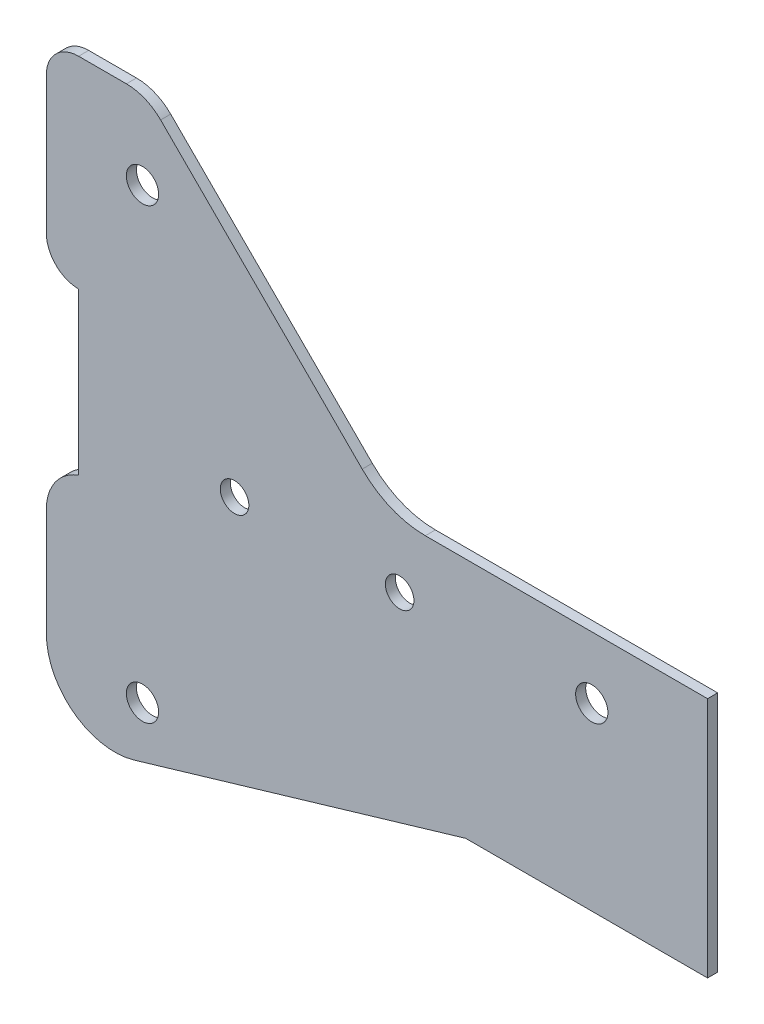
ISO-10303-21;
HEADER;
FILE_DESCRIPTION(('STEP AP214'),'2;1');
FILE_NAME('part.step','',(''),(''),'','','');
FILE_SCHEMA(('AUTOMOTIVE_DESIGN { 1 0 10303 214 1 1 1 1 }'));
ENDSEC;
DATA;
#1=APPLICATION_CONTEXT('core data for automotive mechanical design processes');
#2=APPLICATION_PROTOCOL_DEFINITION('international standard','automotive_design',2000,#1);
#3=PRODUCT_CONTEXT('',#1,'mechanical');
#4=PRODUCT('Part','Part','',(#3));
#5=PRODUCT_RELATED_PRODUCT_CATEGORY('part','',(#4));
#6=PRODUCT_DEFINITION_FORMATION('','',#4);
#7=PRODUCT_DEFINITION_CONTEXT('part definition',#1,'design');
#8=PRODUCT_DEFINITION('design','',#6,#7);
#9=PRODUCT_DEFINITION_SHAPE('','',#8);
#10=(LENGTH_UNIT() NAMED_UNIT(*) SI_UNIT(.MILLI.,.METRE.));
#11=(NAMED_UNIT(*) PLANE_ANGLE_UNIT() SI_UNIT($,.RADIAN.));
#12=(NAMED_UNIT(*) SI_UNIT($,.STERADIAN.) SOLID_ANGLE_UNIT());
#13=UNCERTAINTY_MEASURE_WITH_UNIT(LENGTH_MEASURE(1.E-05),#10,'distance_accuracy_value','');
#14=(GEOMETRIC_REPRESENTATION_CONTEXT(3) GLOBAL_UNCERTAINTY_ASSIGNED_CONTEXT((#13)) GLOBAL_UNIT_ASSIGNED_CONTEXT((#10,
#11,#12)) REPRESENTATION_CONTEXT('',''));
#15=CARTESIAN_POINT('',(0.,0.,0.));
#16=DIRECTION('',(0.,0.,1.));
#17=DIRECTION('',(1.,0.,0.));
#18=AXIS2_PLACEMENT_3D('',#15,#16,#17);
#19=CARTESIAN_POINT('',(-93.3643185723685,-43.1993185723686,1.5875));
#20=DIRECTION('',(0.,0.,1.));
#21=DIRECTION('',(1.,0.,0.));
#22=AXIS2_PLACEMENT_3D('',#19,#20,#21);
#23=PLANE('',#22);
#24=CARTESIAN_POINT('',(-74.5,-9.75000000000002,1.5875));
#25=DIRECTION('',(0.,0.,1.));
#26=DIRECTION('',(1.,0.,0.));
#27=AXIS2_PLACEMENT_3D('',#24,#25,#26);
#28=CIRCLE('',#27,2.25);
#29=CARTESIAN_POINT('',(-72.25,-9.75000000000002,1.5875));
#30=VERTEX_POINT('',#29);
#31=EDGE_CURVE('E334',#30,#30,#28,.T.);
#32=ORIENTED_EDGE('',*,*,#31,.F.);
#33=EDGE_LOOP('',(#32));
#34=FACE_BOUND('',#33,.T.);
#35=CARTESIAN_POINT('',(-89.,25.555,1.5875));
#36=DIRECTION('',(0.,0.,1.));
#37=DIRECTION('',(1.,0.,0.));
#38=AXIS2_PLACEMENT_3D('',#35,#36,#37);
#39=CIRCLE('',#38,2.53999999999998);
#40=CARTESIAN_POINT('',(-86.46,25.555,1.5875));
#41=VERTEX_POINT('',#40);
#42=EDGE_CURVE('E346',#41,#41,#39,.T.);
#43=ORIENTED_EDGE('',*,*,#42,.F.);
#44=EDGE_LOOP('',(#43));
#45=FACE_BOUND('',#44,.T.);
#46=DIRECTION('',(0.,1.,0.));
#47=VECTOR('',#46,1.);
#48=CARTESIAN_POINT('',(0.,0.,1.5875));
#49=LINE('',#48,#47);
#50=CARTESIAN_POINT('',(0.,-38.1,1.5875));
#51=VERTEX_POINT('',#50);
#52=CARTESIAN_POINT('',(0.,0.,1.5875));
#53=VERTEX_POINT('',#52);
#54=EDGE_CURVE('E201',#51,#53,#49,.T.);
#55=ORIENTED_EDGE('',*,*,#54,.T.);
#56=DIRECTION('',(-1.,0.,0.));
#57=VECTOR('',#56,1.);
#58=CARTESIAN_POINT('',(0.,0.,1.5875));
#59=LINE('',#58,#57);
#60=CARTESIAN_POINT('',(-44.45,0.,1.5875));
#61=VERTEX_POINT('',#60);
#62=EDGE_CURVE('E114',#53,#61,#59,.T.);
#63=ORIENTED_EDGE('',*,*,#62,.T.);
#64=CARTESIAN_POINT('',(-44.45,14.0602561210687,1.5875));
#65=DIRECTION('',(0.,0.,-1.));
#66=DIRECTION('',(1.,0.,0.));
#67=AXIS2_PLACEMENT_3D('',#64,#65,#66);
#68=CIRCLE('',#67,14.0602561210687);
#69=CARTESIAN_POINT('',(-54.3921024484273,4.11815367264137,1.5875));
#70=VERTEX_POINT('',#69);
#71=EDGE_CURVE('E237',#61,#70,#68,.T.);
#72=ORIENTED_EDGE('',*,*,#71,.T.);
#73=DIRECTION('',(-0.707106781186547,0.707106781186548,0.));
#74=VECTOR('',#73,1.);
#75=CARTESIAN_POINT('',(-54.3921024484273,4.11815367264137,1.5875));
#76=LINE('',#75,#74);
#77=CARTESIAN_POINT('',(-86.1421024484273,35.8681536726415,1.5875));
#78=VERTEX_POINT('',#77);
#79=EDGE_CURVE('E256',#70,#78,#76,.T.);
#80=ORIENTED_EDGE('',*,*,#79,.T.);
#81=CARTESIAN_POINT('',(-91.5302561210688,30.48,1.5875));
#82=DIRECTION('',(0.,0.,1.));
#83=DIRECTION('',(-1.,0.,0.));
#84=AXIS2_PLACEMENT_3D('',#81,#82,#83);
#85=CIRCLE('',#84,7.61999999999999);
#86=CARTESIAN_POINT('',(-91.5302561210688,38.1,1.5875));
#87=VERTEX_POINT('',#86);
#88=EDGE_CURVE('E253',#78,#87,#85,.T.);
#89=ORIENTED_EDGE('',*,*,#88,.T.);
#90=DIRECTION('',(-1.,0.,0.));
#91=VECTOR('',#90,1.);
#92=CARTESIAN_POINT('',(-99.06,38.1,1.5875));
#93=LINE('',#92,#91);
#94=CARTESIAN_POINT('',(-99.06,38.1,1.5875));
#95=VERTEX_POINT('',#94);
#96=EDGE_CURVE('E255',#87,#95,#93,.T.);
#97=ORIENTED_EDGE('',*,*,#96,.T.);
#98=CARTESIAN_POINT('',(-99.06,33.02,1.5875));
#99=DIRECTION('',(0.,0.,1.));
#100=DIRECTION('',(1.,0.,0.));
#101=AXIS2_PLACEMENT_3D('',#98,#99,#100);
#102=CIRCLE('',#101,5.08);
#103=CARTESIAN_POINT('',(-104.14,33.02,1.5875));
#104=VERTEX_POINT('',#103);
#105=EDGE_CURVE('E258',#95,#104,#102,.T.);
#106=ORIENTED_EDGE('',*,*,#105,.T.);
#107=DIRECTION('',(0.,-1.,0.));
#108=VECTOR('',#107,1.);
#109=CARTESIAN_POINT('',(-104.14,33.02,1.5875));
#110=LINE('',#109,#108);
#111=CARTESIAN_POINT('',(-104.14,11.43,1.5875));
#112=VERTEX_POINT('',#111);
#113=EDGE_CURVE('E264',#104,#112,#110,.T.);
#114=ORIENTED_EDGE('',*,*,#113,.T.);
#115=CARTESIAN_POINT('',(-99.06,11.43,1.5875));
#116=DIRECTION('',(0.,0.,1.));
#117=DIRECTION('',(1.,0.,0.));
#118=AXIS2_PLACEMENT_3D('',#115,#116,#117);
#119=CIRCLE('',#118,5.08);
#120=CARTESIAN_POINT('',(-99.06,6.35,1.5875));
#121=VERTEX_POINT('',#120);
#122=EDGE_CURVE('E266',#112,#121,#119,.T.);
#123=ORIENTED_EDGE('',*,*,#122,.T.);
#124=DIRECTION('',(0.,-1.,0.));
#125=VECTOR('',#124,1.);
#126=CARTESIAN_POINT('',(-99.06,6.35,1.5875));
#127=LINE('',#126,#125);
#128=CARTESIAN_POINT('',(-99.06,-19.05,1.5875));
#129=VERTEX_POINT('',#128);
#130=EDGE_CURVE('E268',#121,#129,#127,.T.);
#131=ORIENTED_EDGE('',*,*,#130,.T.);
#132=CARTESIAN_POINT('',(-96.52,-26.2342048968553,1.5875));
#133=DIRECTION('',(0.,0.,1.));
#134=DIRECTION('',(1.,0.,0.));
#135=AXIS2_PLACEMENT_3D('',#132,#133,#134);
#136=CIRCLE('',#135,7.61999999999999);
#137=CARTESIAN_POINT('',(-104.14,-26.2342048968553,1.5875));
#138=VERTEX_POINT('',#137);
#139=EDGE_CURVE('E270',#129,#138,#136,.T.);
#140=ORIENTED_EDGE('',*,*,#139,.T.);
#141=DIRECTION('',(0.,-1.,0.));
#142=VECTOR('',#141,1.);
#143=CARTESIAN_POINT('',(-104.14,-26.2342048968553,1.5875));
#144=LINE('',#143,#142);
#145=CARTESIAN_POINT('',(-104.14,-43.1993185723686,1.5875));
#146=VERTEX_POINT('',#145);
#147=EDGE_CURVE('E154',#138,#146,#144,.T.);
#148=ORIENTED_EDGE('',*,*,#147,.T.);
#149=CARTESIAN_POINT('',(-93.3643185723685,-43.1993185723686,1.5875));
#150=DIRECTION('',(0.,0.,1.));
#151=DIRECTION('',(1.,0.,0.));
#152=AXIS2_PLACEMENT_3D('',#149,#150,#151);
#153=CIRCLE('',#152,10.7756814276314);
#154=CARTESIAN_POINT('',(-90.309725680807,-53.5329903542969,1.5875));
#155=VERTEX_POINT('',#154);
#156=EDGE_CURVE('E148',#146,#155,#153,.T.);
#157=ORIENTED_EDGE('',*,*,#156,.T.);
#158=DIRECTION('',(0.958980817253038,0.283470972307035,0.));
#159=VECTOR('',#158,1.);
#160=CARTESIAN_POINT('',(-38.1,-38.1,1.5875));
#161=LINE('',#160,#159);
#162=CARTESIAN_POINT('',(-38.1,-38.1,1.5875));
#163=VERTEX_POINT('',#162);
#164=EDGE_CURVE('E152',#155,#163,#161,.T.);
#165=ORIENTED_EDGE('',*,*,#164,.T.);
#166=DIRECTION('',(1.,0.,0.));
#167=VECTOR('',#166,1.);
#168=CARTESIAN_POINT('',(0.,-38.1,1.5875));
#169=LINE('',#168,#167);
#170=EDGE_CURVE('E50',#163,#51,#169,.T.);
#171=ORIENTED_EDGE('',*,*,#170,.T.);
#172=EDGE_LOOP('',(#55,#63,#72,#80,#89,#97,#106,#114,#123,#131,#140,#148,#157,#165,#171));
#173=FACE_BOUND('',#172,.T.);
#174=CARTESIAN_POINT('',(-89.,-45.055,1.5875));
#175=DIRECTION('',(0.,0.,1.));
#176=DIRECTION('',(1.,0.,0.));
#177=AXIS2_PLACEMENT_3D('',#174,#175,#176);
#178=CIRCLE('',#177,2.54);
#179=CARTESIAN_POINT('',(-86.46,-45.055,1.5875));
#180=VERTEX_POINT('',#179);
#181=EDGE_CURVE('E176',#180,#180,#178,.T.);
#182=ORIENTED_EDGE('',*,*,#181,.F.);
#183=EDGE_LOOP('',(#182));
#184=FACE_BOUND('',#183,.T.);
#185=CARTESIAN_POINT('',(-18.24,-9.75,1.5875));
#186=DIRECTION('',(0.,0.,1.));
#187=DIRECTION('',(1.,0.,0.));
#188=AXIS2_PLACEMENT_3D('',#185,#186,#187);
#189=CIRCLE('',#188,2.54);
#190=CARTESIAN_POINT('',(-15.7,-9.75,1.5875));
#191=VERTEX_POINT('',#190);
#192=EDGE_CURVE('E340',#191,#191,#189,.T.);
#193=ORIENTED_EDGE('',*,*,#192,.F.);
#194=EDGE_LOOP('',(#193));
#195=FACE_BOUND('',#194,.T.);
#196=CARTESIAN_POINT('',(-48.5,-9.75000000000002,1.5875));
#197=DIRECTION('',(0.,0.,1.));
#198=DIRECTION('',(1.,0.,0.));
#199=AXIS2_PLACEMENT_3D('',#196,#197,#198);
#200=CIRCLE('',#199,2.25);
#201=CARTESIAN_POINT('',(-46.25,-9.75000000000002,1.5875));
#202=VERTEX_POINT('',#201);
#203=EDGE_CURVE('E325',#202,#202,#200,.T.);
#204=ORIENTED_EDGE('',*,*,#203,.F.);
#205=EDGE_LOOP('',(#204));
#206=FACE_BOUND('',#205,.T.);
#207=ADVANCED_FACE('F33',(#34,#45,#173,#184,#195,#206),#23,.T.);
#208=CARTESIAN_POINT('',(-93.3643185723685,-43.1993185723686,0.));
#209=DIRECTION('',(0.,0.,1.));
#210=DIRECTION('',(1.,0.,0.));
#211=AXIS2_PLACEMENT_3D('',#208,#209,#210);
#212=PLANE('',#211);
#213=DIRECTION('',(0.,1.,0.));
#214=VECTOR('',#213,1.);
#215=CARTESIAN_POINT('',(0.,0.,0.));
#216=LINE('',#215,#214);
#217=CARTESIAN_POINT('',(0.,-38.1,0.));
#218=VERTEX_POINT('',#217);
#219=CARTESIAN_POINT('',(0.,0.,0.));
#220=VERTEX_POINT('',#219);
#221=EDGE_CURVE('E172',#218,#220,#216,.T.);
#222=ORIENTED_EDGE('',*,*,#221,.F.);
#223=DIRECTION('',(1.,0.,0.));
#224=VECTOR('',#223,1.);
#225=CARTESIAN_POINT('',(0.,-38.1,0.));
#226=LINE('',#225,#224);
#227=CARTESIAN_POINT('',(-38.1,-38.1,0.));
#228=VERTEX_POINT('',#227);
#229=EDGE_CURVE('E106',#228,#218,#226,.T.);
#230=ORIENTED_EDGE('',*,*,#229,.F.);
#231=DIRECTION('',(0.958980817253038,0.283470972307035,0.));
#232=VECTOR('',#231,1.);
#233=CARTESIAN_POINT('',(-38.1,-38.1,0.));
#234=LINE('',#233,#232);
#235=CARTESIAN_POINT('',(-90.309725680807,-53.5329903542969,0.));
#236=VERTEX_POINT('',#235);
#237=EDGE_CURVE('E100',#236,#228,#234,.T.);
#238=ORIENTED_EDGE('',*,*,#237,.F.);
#239=CARTESIAN_POINT('',(-93.3643185723685,-43.1993185723686,0.));
#240=DIRECTION('',(0.,0.,1.));
#241=DIRECTION('',(1.,0.,0.));
#242=AXIS2_PLACEMENT_3D('',#239,#240,#241);
#243=CIRCLE('',#242,10.7756814276314);
#244=CARTESIAN_POINT('',(-104.14,-43.1993185723686,0.));
#245=VERTEX_POINT('',#244);
#246=EDGE_CURVE('E162',#245,#236,#243,.T.);
#247=ORIENTED_EDGE('',*,*,#246,.F.);
#248=DIRECTION('',(0.,-1.,0.));
#249=VECTOR('',#248,1.);
#250=CARTESIAN_POINT('',(-104.14,-26.2342048968553,0.));
#251=LINE('',#250,#249);
#252=CARTESIAN_POINT('',(-104.14,-26.2342048968553,0.));
#253=VERTEX_POINT('',#252);
#254=EDGE_CURVE('E196',#253,#245,#251,.T.);
#255=ORIENTED_EDGE('',*,*,#254,.F.);
#256=CARTESIAN_POINT('',(-96.52,-26.2342048968553,0.));
#257=DIRECTION('',(0.,0.,1.));
#258=DIRECTION('',(1.,0.,0.));
#259=AXIS2_PLACEMENT_3D('',#256,#257,#258);
#260=CIRCLE('',#259,7.61999999999999);
#261=CARTESIAN_POINT('',(-99.06,-19.05,0.));
#262=VERTEX_POINT('',#261);
#263=EDGE_CURVE('E194',#262,#253,#260,.T.);
#264=ORIENTED_EDGE('',*,*,#263,.F.);
#265=DIRECTION('',(0.,-1.,0.));
#266=VECTOR('',#265,1.);
#267=CARTESIAN_POINT('',(-99.06,6.35,0.));
#268=LINE('',#267,#266);
#269=CARTESIAN_POINT('',(-99.06,6.35,0.));
#270=VERTEX_POINT('',#269);
#271=EDGE_CURVE('E192',#270,#262,#268,.T.);
#272=ORIENTED_EDGE('',*,*,#271,.F.);
#273=CARTESIAN_POINT('',(-99.06,11.43,0.));
#274=DIRECTION('',(0.,0.,1.));
#275=DIRECTION('',(1.,0.,0.));
#276=AXIS2_PLACEMENT_3D('',#273,#274,#275);
#277=CIRCLE('',#276,5.08);
#278=CARTESIAN_POINT('',(-104.14,11.43,0.));
#279=VERTEX_POINT('',#278);
#280=EDGE_CURVE('E190',#279,#270,#277,.T.);
#281=ORIENTED_EDGE('',*,*,#280,.F.);
#282=DIRECTION('',(0.,-1.,0.));
#283=VECTOR('',#282,1.);
#284=CARTESIAN_POINT('',(-104.14,33.02,0.));
#285=LINE('',#284,#283);
#286=CARTESIAN_POINT('',(-104.14,33.02,0.));
#287=VERTEX_POINT('',#286);
#288=EDGE_CURVE('E188',#287,#279,#285,.T.);
#289=ORIENTED_EDGE('',*,*,#288,.F.);
#290=CARTESIAN_POINT('',(-99.06,33.02,0.));
#291=DIRECTION('',(0.,0.,1.));
#292=DIRECTION('',(1.,0.,0.));
#293=AXIS2_PLACEMENT_3D('',#290,#291,#292);
#294=CIRCLE('',#293,5.08);
#295=CARTESIAN_POINT('',(-99.06,38.1,0.));
#296=VERTEX_POINT('',#295);
#297=EDGE_CURVE('E186',#296,#287,#294,.T.);
#298=ORIENTED_EDGE('',*,*,#297,.F.);
#299=DIRECTION('',(-1.,0.,0.));
#300=VECTOR('',#299,1.);
#301=CARTESIAN_POINT('',(-99.06,38.1,0.));
#302=LINE('',#301,#300);
#303=CARTESIAN_POINT('',(-91.5302561210688,38.1,0.));
#304=VERTEX_POINT('',#303);
#305=EDGE_CURVE('E184',#304,#296,#302,.T.);
#306=ORIENTED_EDGE('',*,*,#305,.F.);
#307=CARTESIAN_POINT('',(-91.5302561210688,30.48,0.));
#308=DIRECTION('',(0.,0.,1.));
#309=DIRECTION('',(-1.,0.,0.));
#310=AXIS2_PLACEMENT_3D('',#307,#308,#309);
#311=CIRCLE('',#310,7.61999999999999);
#312=CARTESIAN_POINT('',(-86.1421024484273,35.8681536726415,0.));
#313=VERTEX_POINT('',#312);
#314=EDGE_CURVE('E182',#313,#304,#311,.T.);
#315=ORIENTED_EDGE('',*,*,#314,.F.);
#316=DIRECTION('',(-0.707106781186547,0.707106781186548,0.));
#317=VECTOR('',#316,1.);
#318=CARTESIAN_POINT('',(-54.3921024484273,4.11815367264137,0.));
#319=LINE('',#318,#317);
#320=CARTESIAN_POINT('',(-54.3921024484273,4.11815367264137,0.));
#321=VERTEX_POINT('',#320);
#322=EDGE_CURVE('E180',#321,#313,#319,.T.);
#323=ORIENTED_EDGE('',*,*,#322,.F.);
#324=CARTESIAN_POINT('',(-44.45,14.0602561210687,0.));
#325=DIRECTION('',(0.,0.,-1.));
#326=DIRECTION('',(1.,0.,0.));
#327=AXIS2_PLACEMENT_3D('',#324,#325,#326);
#328=CIRCLE('',#327,14.0602561210687);
#329=CARTESIAN_POINT('',(-44.45,0.,0.));
#330=VERTEX_POINT('',#329);
#331=EDGE_CURVE('E178',#330,#321,#328,.T.);
#332=ORIENTED_EDGE('',*,*,#331,.F.);
#333=DIRECTION('',(-1.,0.,0.));
#334=VECTOR('',#333,1.);
#335=CARTESIAN_POINT('',(0.,0.,0.));
#336=LINE('',#335,#334);
#337=EDGE_CURVE('E175',#220,#330,#336,.T.);
#338=ORIENTED_EDGE('',*,*,#337,.F.);
#339=EDGE_LOOP('',(#222,#230,#238,#247,#255,#264,#272,#281,#289,#298,#306,#315,#323,#332,#338));
#340=FACE_BOUND('',#339,.T.);
#341=CARTESIAN_POINT('',(-89.,-45.055,0.));
#342=DIRECTION('',(0.,0.,1.));
#343=DIRECTION('',(1.,0.,0.));
#344=AXIS2_PLACEMENT_3D('',#341,#342,#343);
#345=CIRCLE('',#344,2.54);
#346=CARTESIAN_POINT('',(-86.46,-45.055,0.));
#347=VERTEX_POINT('',#346);
#348=EDGE_CURVE('E349',#347,#347,#345,.T.);
#349=ORIENTED_EDGE('',*,*,#348,.T.);
#350=EDGE_LOOP('',(#349));
#351=FACE_BOUND('',#350,.T.);
#352=CARTESIAN_POINT('',(-89.,25.555,0.));
#353=DIRECTION('',(0.,0.,1.));
#354=DIRECTION('',(1.,0.,0.));
#355=AXIS2_PLACEMENT_3D('',#352,#353,#354);
#356=CIRCLE('',#355,2.53999999999998);
#357=CARTESIAN_POINT('',(-86.46,25.555,0.));
#358=VERTEX_POINT('',#357);
#359=EDGE_CURVE('E343',#358,#358,#356,.T.);
#360=ORIENTED_EDGE('',*,*,#359,.T.);
#361=EDGE_LOOP('',(#360));
#362=FACE_BOUND('',#361,.T.);
#363=CARTESIAN_POINT('',(-18.24,-9.75,0.));
#364=DIRECTION('',(0.,0.,1.));
#365=DIRECTION('',(1.,0.,0.));
#366=AXIS2_PLACEMENT_3D('',#363,#364,#365);
#367=CIRCLE('',#366,2.54);
#368=CARTESIAN_POINT('',(-15.7,-9.75,0.));
#369=VERTEX_POINT('',#368);
#370=EDGE_CURVE('E337',#369,#369,#367,.T.);
#371=ORIENTED_EDGE('',*,*,#370,.T.);
#372=EDGE_LOOP('',(#371));
#373=FACE_BOUND('',#372,.T.);
#374=CARTESIAN_POINT('',(-74.5,-9.75000000000002,0.));
#375=DIRECTION('',(0.,0.,1.));
#376=DIRECTION('',(1.,0.,0.));
#377=AXIS2_PLACEMENT_3D('',#374,#375,#376);
#378=CIRCLE('',#377,2.25);
#379=CARTESIAN_POINT('',(-72.25,-9.75000000000002,0.));
#380=VERTEX_POINT('',#379);
#381=EDGE_CURVE('E331',#380,#380,#378,.T.);
#382=ORIENTED_EDGE('',*,*,#381,.T.);
#383=EDGE_LOOP('',(#382));
#384=FACE_BOUND('',#383,.T.);
#385=CARTESIAN_POINT('',(-48.5,-9.75000000000002,0.));
#386=DIRECTION('',(0.,0.,1.));
#387=DIRECTION('',(1.,0.,0.));
#388=AXIS2_PLACEMENT_3D('',#385,#386,#387);
#389=CIRCLE('',#388,2.25);
#390=CARTESIAN_POINT('',(-46.25,-9.75000000000002,0.));
#391=VERTEX_POINT('',#390);
#392=EDGE_CURVE('E328',#391,#391,#389,.T.);
#393=ORIENTED_EDGE('',*,*,#392,.T.);
#394=EDGE_LOOP('',(#393));
#395=FACE_BOUND('',#394,.T.);
#396=ADVANCED_FACE('F241',(#340,#351,#362,#373,#384,#395),#212,.F.);
#397=CARTESIAN_POINT('',(0.,0.,1.5875));
#398=DIRECTION('',(-1.,0.,0.));
#399=DIRECTION('',(0.,-1.,0.));
#400=AXIS2_PLACEMENT_3D('',#397,#398,#399);
#401=PLANE('',#400);
#402=ORIENTED_EDGE('',*,*,#221,.T.);
#403=DIRECTION('',(0.,0.,-1.));
#404=VECTOR('',#403,1.);
#405=CARTESIAN_POINT('',(0.,0.,1.5875));
#406=LINE('',#405,#404);
#407=EDGE_CURVE('E11',#53,#220,#406,.T.);
#408=ORIENTED_EDGE('',*,*,#407,.F.);
#409=ORIENTED_EDGE('',*,*,#54,.F.);
#410=DIRECTION('',(0.,0.,-1.));
#411=VECTOR('',#410,1.);
#412=CARTESIAN_POINT('',(0.,-38.1,1.5875));
#413=LINE('',#412,#411);
#414=EDGE_CURVE('E168',#51,#218,#413,.T.);
#415=ORIENTED_EDGE('',*,*,#414,.T.);
#416=EDGE_LOOP('',(#402,#408,#409,#415));
#417=FACE_BOUND('',#416,.T.);
#418=ADVANCED_FACE('F35',(#417),#401,.F.);
#419=CARTESIAN_POINT('',(0.,0.,1.5875));
#420=DIRECTION('',(0.,-1.,0.));
#421=DIRECTION('',(1.,0.,0.));
#422=AXIS2_PLACEMENT_3D('',#419,#420,#421);
#423=PLANE('',#422);
#424=ORIENTED_EDGE('',*,*,#337,.T.);
#425=DIRECTION('',(0.,0.,-1.));
#426=VECTOR('',#425,1.);
#427=CARTESIAN_POINT('',(-44.45,0.,1.5875));
#428=LINE('',#427,#426);
#429=EDGE_CURVE('E42',#61,#330,#428,.T.);
#430=ORIENTED_EDGE('',*,*,#429,.F.);
#431=ORIENTED_EDGE('',*,*,#62,.F.);
#432=ORIENTED_EDGE('',*,*,#407,.T.);
#433=EDGE_LOOP('',(#424,#430,#431,#432));
#434=FACE_BOUND('',#433,.T.);
#435=ADVANCED_FACE('F498',(#434),#423,.F.);
#436=CARTESIAN_POINT('',(-44.45,14.0602561210687,1.5875));
#437=DIRECTION('',(0.,0.,-1.));
#438=DIRECTION('',(-1.,0.,0.));
#439=AXIS2_PLACEMENT_3D('',#436,#437,#438);
#440=CYLINDRICAL_SURFACE('',#439,14.0602561210687);
#441=ORIENTED_EDGE('',*,*,#331,.T.);
#442=DIRECTION('',(0.,0.,-1.));
#443=VECTOR('',#442,1.);
#444=CARTESIAN_POINT('',(-54.3921024484273,4.11815367264137,1.5875));
#445=LINE('',#444,#443);
#446=EDGE_CURVE('E229',#70,#321,#445,.T.);
#447=ORIENTED_EDGE('',*,*,#446,.F.);
#448=ORIENTED_EDGE('',*,*,#71,.F.);
#449=ORIENTED_EDGE('',*,*,#429,.T.);
#450=EDGE_LOOP('',(#441,#447,#448,#449));
#451=FACE_BOUND('',#450,.T.);
#452=ADVANCED_FACE('F235',(#451),#440,.F.);
#453=CARTESIAN_POINT('',(-54.3921024484273,4.11815367264137,1.5875));
#454=DIRECTION('',(-0.707106781186548,-0.707106781186547,0.));
#455=DIRECTION('',(0.707106781186547,-0.707106781186548,0.));
#456=AXIS2_PLACEMENT_3D('',#453,#454,#455);
#457=PLANE('',#456);
#458=ORIENTED_EDGE('',*,*,#322,.T.);
#459=DIRECTION('',(0.,0.,-1.));
#460=VECTOR('',#459,1.);
#461=CARTESIAN_POINT('',(-86.1421024484273,35.8681536726415,1.5875));
#462=LINE('',#461,#460);
#463=EDGE_CURVE('E226',#78,#313,#462,.T.);
#464=ORIENTED_EDGE('',*,*,#463,.F.);
#465=ORIENTED_EDGE('',*,*,#79,.F.);
#466=ORIENTED_EDGE('',*,*,#446,.T.);
#467=EDGE_LOOP('',(#458,#464,#465,#466));
#468=FACE_BOUND('',#467,.T.);
#469=ADVANCED_FACE('F247',(#468),#457,.F.);
#470=CARTESIAN_POINT('',(-91.5302561210688,30.48,1.5875));
#471=DIRECTION('',(0.,0.,-1.));
#472=DIRECTION('',(-1.,0.,0.));
#473=AXIS2_PLACEMENT_3D('',#470,#471,#472);
#474=CYLINDRICAL_SURFACE('',#473,7.61999999999999);
#475=ORIENTED_EDGE('',*,*,#314,.T.);
#476=DIRECTION('',(0.,0.,-1.));
#477=VECTOR('',#476,1.);
#478=CARTESIAN_POINT('',(-91.5302561210688,38.1,1.5875));
#479=LINE('',#478,#477);
#480=EDGE_CURVE('E223',#87,#304,#479,.T.);
#481=ORIENTED_EDGE('',*,*,#480,.F.);
#482=ORIENTED_EDGE('',*,*,#88,.F.);
#483=ORIENTED_EDGE('',*,*,#463,.T.);
#484=EDGE_LOOP('',(#475,#481,#482,#483));
#485=FACE_BOUND('',#484,.T.);
#486=ADVANCED_FACE('F251',(#485),#474,.T.);
#487=CARTESIAN_POINT('',(-99.06,38.1,1.5875));
#488=DIRECTION('',(0.,-1.,0.));
#489=DIRECTION('',(1.,0.,0.));
#490=AXIS2_PLACEMENT_3D('',#487,#488,#489);
#491=PLANE('',#490);
#492=ORIENTED_EDGE('',*,*,#305,.T.);
#493=DIRECTION('',(0.,0.,-1.));
#494=VECTOR('',#493,1.);
#495=CARTESIAN_POINT('',(-99.06,38.1,1.5875));
#496=LINE('',#495,#494);
#497=EDGE_CURVE('E220',#95,#296,#496,.T.);
#498=ORIENTED_EDGE('',*,*,#497,.F.);
#499=ORIENTED_EDGE('',*,*,#96,.F.);
#500=ORIENTED_EDGE('',*,*,#480,.T.);
#501=EDGE_LOOP('',(#492,#498,#499,#500));
#502=FACE_BOUND('',#501,.T.);
#503=ADVANCED_FACE('F463',(#502),#491,.F.);
#504=CARTESIAN_POINT('',(-99.06,33.02,1.5875));
#505=DIRECTION('',(0.,0.,-1.));
#506=DIRECTION('',(-1.,0.,0.));
#507=AXIS2_PLACEMENT_3D('',#504,#505,#506);
#508=CYLINDRICAL_SURFACE('',#507,5.08);
#509=ORIENTED_EDGE('',*,*,#297,.T.);
#510=DIRECTION('',(0.,0.,-1.));
#511=VECTOR('',#510,1.);
#512=CARTESIAN_POINT('',(-104.14,33.02,1.5875));
#513=LINE('',#512,#511);
#514=EDGE_CURVE('E217',#104,#287,#513,.T.);
#515=ORIENTED_EDGE('',*,*,#514,.F.);
#516=ORIENTED_EDGE('',*,*,#105,.F.);
#517=ORIENTED_EDGE('',*,*,#497,.T.);
#518=EDGE_LOOP('',(#509,#515,#516,#517));
#519=FACE_BOUND('',#518,.T.);
#520=ADVANCED_FACE('F453',(#519),#508,.T.);
#521=CARTESIAN_POINT('',(-104.14,33.02,1.5875));
#522=DIRECTION('',(1.,0.,0.));
#523=DIRECTION('',(0.,1.,0.));
#524=AXIS2_PLACEMENT_3D('',#521,#522,#523);
#525=PLANE('',#524);
#526=ORIENTED_EDGE('',*,*,#288,.T.);
#527=DIRECTION('',(0.,0.,-1.));
#528=VECTOR('',#527,1.);
#529=CARTESIAN_POINT('',(-104.14,11.43,1.5875));
#530=LINE('',#529,#528);
#531=EDGE_CURVE('E214',#112,#279,#530,.T.);
#532=ORIENTED_EDGE('',*,*,#531,.F.);
#533=ORIENTED_EDGE('',*,*,#113,.F.);
#534=ORIENTED_EDGE('',*,*,#514,.T.);
#535=EDGE_LOOP('',(#526,#532,#533,#534));
#536=FACE_BOUND('',#535,.T.);
#537=ADVANCED_FACE('F443',(#536),#525,.F.);
#538=CARTESIAN_POINT('',(-99.06,11.43,1.5875));
#539=DIRECTION('',(0.,0.,-1.));
#540=DIRECTION('',(-1.,0.,0.));
#541=AXIS2_PLACEMENT_3D('',#538,#539,#540);
#542=CYLINDRICAL_SURFACE('',#541,5.08);
#543=ORIENTED_EDGE('',*,*,#280,.T.);
#544=DIRECTION('',(0.,0.,-1.));
#545=VECTOR('',#544,1.);
#546=CARTESIAN_POINT('',(-99.06,6.35,1.5875));
#547=LINE('',#546,#545);
#548=EDGE_CURVE('E211',#121,#270,#547,.T.);
#549=ORIENTED_EDGE('',*,*,#548,.F.);
#550=ORIENTED_EDGE('',*,*,#122,.F.);
#551=ORIENTED_EDGE('',*,*,#531,.T.);
#552=EDGE_LOOP('',(#543,#549,#550,#551));
#553=FACE_BOUND('',#552,.T.);
#554=ADVANCED_FACE('F433',(#553),#542,.T.);
#555=CARTESIAN_POINT('',(-99.06,6.35,1.5875));
#556=DIRECTION('',(1.,0.,0.));
#557=DIRECTION('',(0.,0.,-1.));
#558=AXIS2_PLACEMENT_3D('',#555,#556,#557);
#559=PLANE('',#558);
#560=ORIENTED_EDGE('',*,*,#271,.T.);
#561=DIRECTION('',(0.,0.,-1.));
#562=VECTOR('',#561,1.);
#563=CARTESIAN_POINT('',(-99.06,-19.05,1.5875));
#564=LINE('',#563,#562);
#565=EDGE_CURVE('E208',#129,#262,#564,.T.);
#566=ORIENTED_EDGE('',*,*,#565,.F.);
#567=ORIENTED_EDGE('',*,*,#130,.F.);
#568=ORIENTED_EDGE('',*,*,#548,.T.);
#569=EDGE_LOOP('',(#560,#566,#567,#568));
#570=FACE_BOUND('',#569,.T.);
#571=ADVANCED_FACE('F424',(#570),#559,.F.);
#572=CARTESIAN_POINT('',(-96.52,-26.2342048968553,1.5875));
#573=DIRECTION('',(0.,0.,-1.));
#574=DIRECTION('',(-1.,0.,0.));
#575=AXIS2_PLACEMENT_3D('',#572,#573,#574);
#576=CYLINDRICAL_SURFACE('',#575,7.61999999999999);
#577=ORIENTED_EDGE('',*,*,#263,.T.);
#578=DIRECTION('',(0.,0.,-1.));
#579=VECTOR('',#578,1.);
#580=CARTESIAN_POINT('',(-104.14,-26.2342048968553,1.5875));
#581=LINE('',#580,#579);
#582=EDGE_CURVE('E205',#138,#253,#581,.T.);
#583=ORIENTED_EDGE('',*,*,#582,.F.);
#584=ORIENTED_EDGE('',*,*,#139,.F.);
#585=ORIENTED_EDGE('',*,*,#565,.T.);
#586=EDGE_LOOP('',(#577,#583,#584,#585));
#587=FACE_BOUND('',#586,.T.);
#588=ADVANCED_FACE('F276',(#587),#576,.T.);
#589=CARTESIAN_POINT('',(-104.14,-26.2342048968553,1.5875));
#590=DIRECTION('',(1.,0.,0.));
#591=DIRECTION('',(0.,0.,-1.));
#592=AXIS2_PLACEMENT_3D('',#589,#590,#591);
#593=PLANE('',#592);
#594=ORIENTED_EDGE('',*,*,#254,.T.);
#595=DIRECTION('',(0.,0.,-1.));
#596=VECTOR('',#595,1.);
#597=CARTESIAN_POINT('',(-104.14,-43.1993185723686,1.5875));
#598=LINE('',#597,#596);
#599=EDGE_CURVE('E163',#146,#245,#598,.T.);
#600=ORIENTED_EDGE('',*,*,#599,.F.);
#601=ORIENTED_EDGE('',*,*,#147,.F.);
#602=ORIENTED_EDGE('',*,*,#582,.T.);
#603=EDGE_LOOP('',(#594,#600,#601,#602));
#604=FACE_BOUND('',#603,.T.);
#605=ADVANCED_FACE('F280',(#604),#593,.F.);
#606=CARTESIAN_POINT('',(-93.3643185723685,-43.1993185723686,1.5875));
#607=DIRECTION('',(0.,0.,-1.));
#608=DIRECTION('',(-1.,0.,0.));
#609=AXIS2_PLACEMENT_3D('',#606,#607,#608);
#610=CYLINDRICAL_SURFACE('',#609,10.7756814276314);
#611=ORIENTED_EDGE('',*,*,#246,.T.);
#612=DIRECTION('',(0.,0.,-1.));
#613=VECTOR('',#612,1.);
#614=CARTESIAN_POINT('',(-90.309725680807,-53.5329903542969,1.5875));
#615=LINE('',#614,#613);
#616=EDGE_CURVE('E159',#155,#236,#615,.T.);
#617=ORIENTED_EDGE('',*,*,#616,.F.);
#618=ORIENTED_EDGE('',*,*,#156,.F.);
#619=ORIENTED_EDGE('',*,*,#599,.T.);
#620=EDGE_LOOP('',(#611,#617,#618,#619));
#621=FACE_BOUND('',#620,.T.);
#622=ADVANCED_FACE('F160',(#621),#610,.T.);
#623=CARTESIAN_POINT('',(-38.1,-38.1,1.5875));
#624=DIRECTION('',(-0.283470972307035,0.958980817253038,0.));
#625=DIRECTION('',(-0.958980817253038,-0.283470972307035,0.));
#626=AXIS2_PLACEMENT_3D('',#623,#624,#625);
#627=PLANE('',#626);
#628=ORIENTED_EDGE('',*,*,#237,.T.);
#629=DIRECTION('',(0.,0.,-1.));
#630=VECTOR('',#629,1.);
#631=CARTESIAN_POINT('',(-38.1,-38.1,1.5875));
#632=LINE('',#631,#630);
#633=EDGE_CURVE('E164',#163,#228,#632,.T.);
#634=ORIENTED_EDGE('',*,*,#633,.F.);
#635=ORIENTED_EDGE('',*,*,#164,.F.);
#636=ORIENTED_EDGE('',*,*,#616,.T.);
#637=EDGE_LOOP('',(#628,#634,#635,#636));
#638=FACE_BOUND('',#637,.T.);
#639=ADVANCED_FACE('F166',(#638),#627,.F.);
#640=CARTESIAN_POINT('',(0.,-38.1,1.5875));
#641=DIRECTION('',(0.,1.,0.));
#642=DIRECTION('',(-1.,0.,0.));
#643=AXIS2_PLACEMENT_3D('',#640,#641,#642);
#644=PLANE('',#643);
#645=ORIENTED_EDGE('',*,*,#229,.T.);
#646=ORIENTED_EDGE('',*,*,#414,.F.);
#647=ORIENTED_EDGE('',*,*,#170,.F.);
#648=ORIENTED_EDGE('',*,*,#633,.T.);
#649=EDGE_LOOP('',(#645,#646,#647,#648));
#650=FACE_BOUND('',#649,.T.);
#651=ADVANCED_FACE('F284',(#650),#644,.F.);
#652=CARTESIAN_POINT('',(-89.,-45.055,1.5875));
#653=DIRECTION('',(0.,0.,-1.));
#654=DIRECTION('',(-1.,0.,0.));
#655=AXIS2_PLACEMENT_3D('',#652,#653,#654);
#656=CYLINDRICAL_SURFACE('',#655,2.54);
#657=ORIENTED_EDGE('',*,*,#181,.T.);
#658=EDGE_LOOP('',(#657));
#659=FACE_BOUND('',#658,.T.);
#660=ORIENTED_EDGE('',*,*,#348,.F.);
#661=EDGE_LOOP('',(#660));
#662=FACE_BOUND('',#661,.T.);
#663=ADVANCED_FACE('F286',(#659,#662),#656,.F.);
#664=CARTESIAN_POINT('',(-89.,25.555,1.5875));
#665=DIRECTION('',(0.,0.,-1.));
#666=DIRECTION('',(-1.,0.,0.));
#667=AXIS2_PLACEMENT_3D('',#664,#665,#666);
#668=CYLINDRICAL_SURFACE('',#667,2.53999999999998);
#669=ORIENTED_EDGE('',*,*,#42,.T.);
#670=EDGE_LOOP('',(#669));
#671=FACE_BOUND('',#670,.T.);
#672=ORIENTED_EDGE('',*,*,#359,.F.);
#673=EDGE_LOOP('',(#672));
#674=FACE_BOUND('',#673,.T.);
#675=ADVANCED_FACE('F292',(#671,#674),#668,.F.);
#676=CARTESIAN_POINT('',(-18.24,-9.75,1.5875));
#677=DIRECTION('',(0.,0.,-1.));
#678=DIRECTION('',(-1.,0.,0.));
#679=AXIS2_PLACEMENT_3D('',#676,#677,#678);
#680=CYLINDRICAL_SURFACE('',#679,2.54);
#681=ORIENTED_EDGE('',*,*,#192,.T.);
#682=EDGE_LOOP('',(#681));
#683=FACE_BOUND('',#682,.T.);
#684=ORIENTED_EDGE('',*,*,#370,.F.);
#685=EDGE_LOOP('',(#684));
#686=FACE_BOUND('',#685,.T.);
#687=ADVANCED_FACE('F308',(#683,#686),#680,.F.);
#688=CARTESIAN_POINT('',(-74.5,-9.75000000000002,1.5875));
#689=DIRECTION('',(0.,0.,-1.));
#690=DIRECTION('',(-1.,0.,0.));
#691=AXIS2_PLACEMENT_3D('',#688,#689,#690);
#692=CYLINDRICAL_SURFACE('',#691,2.25);
#693=ORIENTED_EDGE('',*,*,#31,.T.);
#694=EDGE_LOOP('',(#693));
#695=FACE_BOUND('',#694,.T.);
#696=ORIENTED_EDGE('',*,*,#381,.F.);
#697=EDGE_LOOP('',(#696));
#698=FACE_BOUND('',#697,.T.);
#699=ADVANCED_FACE('F312',(#695,#698),#692,.F.);
#700=CARTESIAN_POINT('',(-48.5,-9.75000000000002,1.5875));
#701=DIRECTION('',(0.,0.,-1.));
#702=DIRECTION('',(-1.,0.,0.));
#703=AXIS2_PLACEMENT_3D('',#700,#701,#702);
#704=CYLINDRICAL_SURFACE('',#703,2.25);
#705=ORIENTED_EDGE('',*,*,#203,.T.);
#706=EDGE_LOOP('',(#705));
#707=FACE_BOUND('',#706,.T.);
#708=ORIENTED_EDGE('',*,*,#392,.F.);
#709=EDGE_LOOP('',(#708));
#710=FACE_BOUND('',#709,.T.);
#711=ADVANCED_FACE('F316',(#707,#710),#704,.F.);
#712=CLOSED_SHELL('',(#207,#396,#418,#435,#452,#469,#486,#503,#520,#537,#554,#571,#588,#605,
#622,#639,#651,#663,#675,#687,#699,#711));
#713=MANIFOLD_SOLID_BREP('B2',#712);
#714=ADVANCED_BREP_SHAPE_REPRESENTATION('',(#18,#713),#14);
#715=SHAPE_DEFINITION_REPRESENTATION(#9,#714);
ENDSEC;
END-ISO-10303-21;
